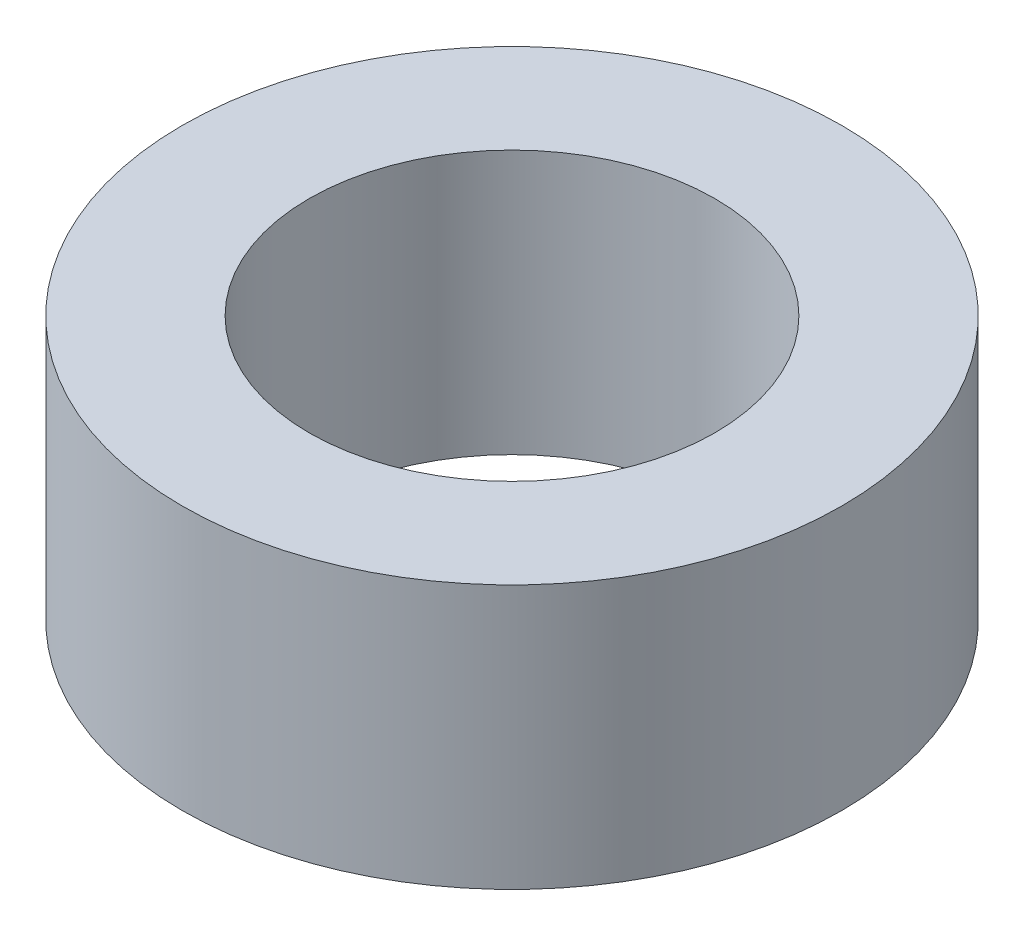
ISO-10303-21;
HEADER;
FILE_DESCRIPTION(('STEP AP214'),'2;1');
FILE_NAME('part.step','',(''),(''),'','','');
FILE_SCHEMA(('AUTOMOTIVE_DESIGN { 1 0 10303 214 1 1 1 1 }'));
ENDSEC;
DATA;
#1=APPLICATION_CONTEXT('core data for automotive mechanical design processes');
#2=APPLICATION_PROTOCOL_DEFINITION('international standard','automotive_design',2000,#1);
#3=PRODUCT_CONTEXT('',#1,'mechanical');
#4=PRODUCT('Part','Part','',(#3));
#5=PRODUCT_RELATED_PRODUCT_CATEGORY('part','',(#4));
#6=PRODUCT_DEFINITION_FORMATION('','',#4);
#7=PRODUCT_DEFINITION_CONTEXT('part definition',#1,'design');
#8=PRODUCT_DEFINITION('design','',#6,#7);
#9=PRODUCT_DEFINITION_SHAPE('','',#8);
#10=(LENGTH_UNIT() NAMED_UNIT(*) SI_UNIT(.MILLI.,.METRE.));
#11=(NAMED_UNIT(*) PLANE_ANGLE_UNIT() SI_UNIT($,.RADIAN.));
#12=(NAMED_UNIT(*) SI_UNIT($,.STERADIAN.) SOLID_ANGLE_UNIT());
#13=UNCERTAINTY_MEASURE_WITH_UNIT(LENGTH_MEASURE(1.E-05),#10,'distance_accuracy_value','');
#14=(GEOMETRIC_REPRESENTATION_CONTEXT(3) GLOBAL_UNCERTAINTY_ASSIGNED_CONTEXT((#13)) GLOBAL_UNIT_ASSIGNED_CONTEXT((#10,
#11,#12)) REPRESENTATION_CONTEXT('',''));
#15=CARTESIAN_POINT('',(0.,0.,0.));
#16=DIRECTION('',(0.,0.,1.));
#17=DIRECTION('',(1.,0.,0.));
#18=AXIS2_PLACEMENT_3D('',#15,#16,#17);
#19=CARTESIAN_POINT('',(0.,26.,0.));
#20=DIRECTION('',(0.,-1.,0.));
#21=DIRECTION('',(0.,0.,-1.));
#22=AXIS2_PLACEMENT_3D('',#19,#20,#21);
#23=CYLINDRICAL_SURFACE('',#22,32.5);
#24=CARTESIAN_POINT('',(0.,26.,0.));
#25=DIRECTION('',(0.,1.,0.));
#26=DIRECTION('',(0.,0.,1.));
#27=AXIS2_PLACEMENT_3D('',#24,#25,#26);
#28=CIRCLE('',#27,32.5);
#29=CARTESIAN_POINT('',(0.,26.,-32.5));
#30=VERTEX_POINT('',#29);
#31=EDGE_CURVE('E10',#30,#30,#28,.T.);
#32=CARTESIAN_POINT('',(0.,0.,0.));
#33=DIRECTION('',(0.,1.,0.));
#34=DIRECTION('',(0.,0.,1.));
#35=AXIS2_PLACEMENT_3D('',#32,#33,#34);
#36=CIRCLE('',#35,32.5);
#37=CARTESIAN_POINT('',(0.,0.,-32.5));
#38=VERTEX_POINT('',#37);
#39=EDGE_CURVE('E37',#38,#38,#36,.T.);
#40=CARTESIAN_POINT('',(0.,26.,-32.5));
#41=CARTESIAN_POINT('',(0.,25.7291666666667,-32.5));
#42=CARTESIAN_POINT('',(0.,25.4583333333333,-32.5));
#43=CARTESIAN_POINT('',(0.,24.9166666666667,-32.5));
#44=CARTESIAN_POINT('',(0.,24.6458333333333,-32.5));
#45=CARTESIAN_POINT('',(0.,24.1041666666667,-32.5));
#46=CARTESIAN_POINT('',(0.,23.8333333333333,-32.5));
#47=CARTESIAN_POINT('',(0.,23.2916666666667,-32.5));
#48=CARTESIAN_POINT('',(0.,23.0208333333333,-32.5));
#49=CARTESIAN_POINT('',(0.,22.4791666666667,-32.5));
#50=CARTESIAN_POINT('',(0.,22.2083333333333,-32.5));
#51=CARTESIAN_POINT('',(0.,21.6666666666667,-32.5));
#52=CARTESIAN_POINT('',(0.,21.3958333333333,-32.5));
#53=CARTESIAN_POINT('',(0.,20.8541666666667,-32.5));
#54=CARTESIAN_POINT('',(0.,20.5833333333333,-32.5));
#55=CARTESIAN_POINT('',(0.,20.0416666666667,-32.5));
#56=CARTESIAN_POINT('',(0.,19.7708333333333,-32.5));
#57=CARTESIAN_POINT('',(0.,19.2291666666667,-32.5));
#58=CARTESIAN_POINT('',(0.,18.9583333333333,-32.5));
#59=CARTESIAN_POINT('',(0.,18.4166666666667,-32.5));
#60=CARTESIAN_POINT('',(0.,18.1458333333333,-32.5));
#61=CARTESIAN_POINT('',(0.,17.6041666666667,-32.5));
#62=CARTESIAN_POINT('',(0.,17.3333333333333,-32.5));
#63=CARTESIAN_POINT('',(0.,16.7916666666667,-32.5));
#64=CARTESIAN_POINT('',(0.,16.5208333333333,-32.5));
#65=CARTESIAN_POINT('',(0.,15.9791666666667,-32.5));
#66=CARTESIAN_POINT('',(0.,15.7083333333333,-32.5));
#67=CARTESIAN_POINT('',(0.,15.1666666666667,-32.5));
#68=CARTESIAN_POINT('',(0.,14.8958333333333,-32.5));
#69=CARTESIAN_POINT('',(0.,14.3541666666667,-32.5));
#70=CARTESIAN_POINT('',(0.,14.0833333333333,-32.5));
#71=CARTESIAN_POINT('',(0.,13.5416666666667,-32.5));
#72=CARTESIAN_POINT('',(0.,13.2708333333333,-32.5));
#73=CARTESIAN_POINT('',(0.,12.7291666666667,-32.5));
#74=CARTESIAN_POINT('',(0.,12.4583333333333,-32.5));
#75=CARTESIAN_POINT('',(0.,11.9166666666667,-32.5));
#76=CARTESIAN_POINT('',(0.,11.6458333333333,-32.5));
#77=CARTESIAN_POINT('',(0.,11.1041666666667,-32.5));
#78=CARTESIAN_POINT('',(0.,10.8333333333333,-32.5));
#79=CARTESIAN_POINT('',(0.,10.2916666666667,-32.5));
#80=CARTESIAN_POINT('',(0.,10.0208333333333,-32.5));
#81=CARTESIAN_POINT('',(0.,9.47916666666667,-32.5));
#82=CARTESIAN_POINT('',(0.,9.20833333333333,-32.5));
#83=CARTESIAN_POINT('',(0.,8.66666666666667,-32.5));
#84=CARTESIAN_POINT('',(0.,8.39583333333333,-32.5));
#85=CARTESIAN_POINT('',(0.,7.85416666666667,-32.5));
#86=CARTESIAN_POINT('',(0.,7.58333333333333,-32.5));
#87=CARTESIAN_POINT('',(0.,7.04166666666667,-32.5));
#88=CARTESIAN_POINT('',(0.,6.77083333333333,-32.5));
#89=CARTESIAN_POINT('',(0.,6.22916666666667,-32.5));
#90=CARTESIAN_POINT('',(0.,5.95833333333333,-32.5));
#91=CARTESIAN_POINT('',(0.,5.41666666666667,-32.5));
#92=CARTESIAN_POINT('',(0.,5.14583333333333,-32.5));
#93=CARTESIAN_POINT('',(0.,4.60416666666667,-32.5));
#94=CARTESIAN_POINT('',(0.,4.33333333333333,-32.5));
#95=CARTESIAN_POINT('',(0.,3.79166666666667,-32.5));
#96=CARTESIAN_POINT('',(0.,3.52083333333333,-32.5));
#97=CARTESIAN_POINT('',(0.,2.97916666666667,-32.5));
#98=CARTESIAN_POINT('',(0.,2.70833333333333,-32.5));
#99=CARTESIAN_POINT('',(0.,2.16666666666667,-32.5));
#100=CARTESIAN_POINT('',(0.,1.89583333333333,-32.5));
#101=CARTESIAN_POINT('',(0.,1.35416666666667,-32.5));
#102=CARTESIAN_POINT('',(0.,1.08333333333333,-32.5));
#103=CARTESIAN_POINT('',(0.,0.541666666666667,-32.5));
#104=CARTESIAN_POINT('',(0.,0.270833333333334,-32.5));
#105=CARTESIAN_POINT('',(0.,0.,-32.5));
#106=B_SPLINE_CURVE_WITH_KNOTS('',3,(#40,#41,#42,#43,#44,#45,#46,#47,#48,#49,#50,#51,#52,#53,
#54,#55,#56,#57,#58,#59,#60,#61,#62,#63,#64,#65,#66,#67,#68,#69,#70,#71,#72,#73,#74,#75,#76,#77,
#78,#79,#80,#81,#82,#83,#84,#85,#86,#87,#88,#89,#90,#91,#92,#93,#94,#95,#96,#97,#98,#99,#100,
#101,#102,#103,#104,#105),.UNSPECIFIED.,.F.,.F.,(4,2,2,2,2,2,2,2,2,2,2,2,2,2,2,2,2,2,2,2,2,2,2,
2,2,2,2,2,2,2,2,2,4),(0.,0.812500000000001,1.625,2.4375,3.25,4.0625,4.875,5.6875,6.5,7.3125,
8.125,8.9375,9.75,10.5625,11.375,12.1875,13.,13.8125,14.625,15.4375,16.25,17.0625,17.875,
18.6875,19.5,20.3125,21.125,21.9375,22.75,23.5625,24.375,25.1875,26.),.UNSPECIFIED.);
#107=EDGE_CURVE('BSEAM40',#30,#38,#106,.T.);
#108=ORIENTED_EDGE('',*,*,#31,.F.);
#109=ORIENTED_EDGE('',*,*,#39,.T.);
#110=ORIENTED_EDGE('',*,*,#107,.T.);
#111=ORIENTED_EDGE('',*,*,#107,.F.);
#112=EDGE_LOOP('',(#108,#110,#109,#111));
#113=FACE_BOUND('',#112,.T.);
#114=ADVANCED_FACE('F40',(#113),#23,.T.);
#115=CARTESIAN_POINT('',(0.,26.,0.));
#116=DIRECTION('',(0.,1.,0.));
#117=DIRECTION('',(0.,0.,1.));
#118=AXIS2_PLACEMENT_3D('',#115,#116,#117);
#119=PLANE('',#118);
#120=CARTESIAN_POINT('',(0.,26.,0.));
#121=DIRECTION('',(0.,1.,0.));
#122=DIRECTION('',(0.,0.,1.));
#123=AXIS2_PLACEMENT_3D('',#120,#121,#122);
#124=CIRCLE('',#123,20.);
#125=CARTESIAN_POINT('',(0.,26.,-20.));
#126=VERTEX_POINT('',#125);
#127=EDGE_CURVE('E50',#126,#126,#124,.T.);
#128=ORIENTED_EDGE('',*,*,#127,.F.);
#129=EDGE_LOOP('',(#128));
#130=FACE_BOUND('',#129,.T.);
#131=ORIENTED_EDGE('',*,*,#31,.T.);
#132=EDGE_LOOP('',(#131));
#133=FACE_BOUND('',#132,.T.);
#134=ADVANCED_FACE('F59',(#130,#133),#119,.T.);
#135=CARTESIAN_POINT('',(0.,0.,0.));
#136=DIRECTION('',(0.,1.,0.));
#137=DIRECTION('',(0.,0.,1.));
#138=AXIS2_PLACEMENT_3D('',#135,#136,#137);
#139=PLANE('',#138);
#140=CARTESIAN_POINT('',(0.,0.,0.));
#141=DIRECTION('',(0.,1.,0.));
#142=DIRECTION('',(0.,0.,1.));
#143=AXIS2_PLACEMENT_3D('',#140,#141,#142);
#144=CIRCLE('',#143,20.);
#145=CARTESIAN_POINT('',(0.,0.,-20.));
#146=VERTEX_POINT('',#145);
#147=EDGE_CURVE('E47',#146,#146,#144,.T.);
#148=ORIENTED_EDGE('',*,*,#147,.T.);
#149=EDGE_LOOP('',(#148));
#150=FACE_BOUND('',#149,.T.);
#151=ORIENTED_EDGE('',*,*,#39,.F.);
#152=EDGE_LOOP('',(#151));
#153=FACE_BOUND('',#152,.T.);
#154=ADVANCED_FACE('F58',(#150,#153),#139,.F.);
#155=CARTESIAN_POINT('',(0.,26.,0.));
#156=DIRECTION('',(0.,-1.,0.));
#157=DIRECTION('',(0.,0.,-1.));
#158=AXIS2_PLACEMENT_3D('',#155,#156,#157);
#159=CYLINDRICAL_SURFACE('',#158,20.);
#160=CARTESIAN_POINT('',(0.,26.,-20.));
#161=CARTESIAN_POINT('',(0.,25.7291666666667,-20.));
#162=CARTESIAN_POINT('',(0.,25.4583333333333,-20.));
#163=CARTESIAN_POINT('',(0.,24.9166666666667,-20.));
#164=CARTESIAN_POINT('',(0.,24.6458333333333,-20.));
#165=CARTESIAN_POINT('',(0.,24.1041666666667,-20.));
#166=CARTESIAN_POINT('',(0.,23.8333333333333,-20.));
#167=CARTESIAN_POINT('',(0.,23.2916666666667,-20.));
#168=CARTESIAN_POINT('',(0.,23.0208333333333,-20.));
#169=CARTESIAN_POINT('',(0.,22.4791666666667,-20.));
#170=CARTESIAN_POINT('',(0.,22.2083333333333,-20.));
#171=CARTESIAN_POINT('',(0.,21.6666666666667,-20.));
#172=CARTESIAN_POINT('',(0.,21.3958333333333,-20.));
#173=CARTESIAN_POINT('',(0.,20.8541666666667,-20.));
#174=CARTESIAN_POINT('',(0.,20.5833333333333,-20.));
#175=CARTESIAN_POINT('',(0.,20.0416666666667,-20.));
#176=CARTESIAN_POINT('',(0.,19.7708333333333,-20.));
#177=CARTESIAN_POINT('',(0.,19.2291666666667,-20.));
#178=CARTESIAN_POINT('',(0.,18.9583333333333,-20.));
#179=CARTESIAN_POINT('',(0.,18.4166666666667,-20.));
#180=CARTESIAN_POINT('',(0.,18.1458333333333,-20.));
#181=CARTESIAN_POINT('',(0.,17.6041666666667,-20.));
#182=CARTESIAN_POINT('',(0.,17.3333333333333,-20.));
#183=CARTESIAN_POINT('',(0.,16.7916666666667,-20.));
#184=CARTESIAN_POINT('',(0.,16.5208333333333,-20.));
#185=CARTESIAN_POINT('',(0.,15.9791666666667,-20.));
#186=CARTESIAN_POINT('',(0.,15.7083333333333,-20.));
#187=CARTESIAN_POINT('',(0.,15.1666666666667,-20.));
#188=CARTESIAN_POINT('',(0.,14.8958333333333,-20.));
#189=CARTESIAN_POINT('',(0.,14.3541666666667,-20.));
#190=CARTESIAN_POINT('',(0.,14.0833333333333,-20.));
#191=CARTESIAN_POINT('',(0.,13.5416666666667,-20.));
#192=CARTESIAN_POINT('',(0.,13.2708333333333,-20.));
#193=CARTESIAN_POINT('',(0.,12.7291666666667,-20.));
#194=CARTESIAN_POINT('',(0.,12.4583333333333,-20.));
#195=CARTESIAN_POINT('',(0.,11.9166666666667,-20.));
#196=CARTESIAN_POINT('',(0.,11.6458333333333,-20.));
#197=CARTESIAN_POINT('',(0.,11.1041666666667,-20.));
#198=CARTESIAN_POINT('',(0.,10.8333333333333,-20.));
#199=CARTESIAN_POINT('',(0.,10.2916666666667,-20.));
#200=CARTESIAN_POINT('',(0.,10.0208333333333,-20.));
#201=CARTESIAN_POINT('',(0.,9.47916666666667,-20.));
#202=CARTESIAN_POINT('',(0.,9.20833333333333,-20.));
#203=CARTESIAN_POINT('',(0.,8.66666666666667,-20.));
#204=CARTESIAN_POINT('',(0.,8.39583333333333,-20.));
#205=CARTESIAN_POINT('',(0.,7.85416666666667,-20.));
#206=CARTESIAN_POINT('',(0.,7.58333333333333,-20.));
#207=CARTESIAN_POINT('',(0.,7.04166666666667,-20.));
#208=CARTESIAN_POINT('',(0.,6.77083333333333,-20.));
#209=CARTESIAN_POINT('',(0.,6.22916666666667,-20.));
#210=CARTESIAN_POINT('',(0.,5.95833333333333,-20.));
#211=CARTESIAN_POINT('',(0.,5.41666666666667,-20.));
#212=CARTESIAN_POINT('',(0.,5.14583333333333,-20.));
#213=CARTESIAN_POINT('',(0.,4.60416666666667,-20.));
#214=CARTESIAN_POINT('',(0.,4.33333333333333,-20.));
#215=CARTESIAN_POINT('',(0.,3.79166666666667,-20.));
#216=CARTESIAN_POINT('',(0.,3.52083333333333,-20.));
#217=CARTESIAN_POINT('',(0.,2.97916666666667,-20.));
#218=CARTESIAN_POINT('',(0.,2.70833333333333,-20.));
#219=CARTESIAN_POINT('',(0.,2.16666666666667,-20.));
#220=CARTESIAN_POINT('',(0.,1.89583333333333,-20.));
#221=CARTESIAN_POINT('',(0.,1.35416666666667,-20.));
#222=CARTESIAN_POINT('',(0.,1.08333333333333,-20.));
#223=CARTESIAN_POINT('',(0.,0.541666666666667,-20.));
#224=CARTESIAN_POINT('',(0.,0.270833333333334,-20.));
#225=CARTESIAN_POINT('',(0.,0.,-20.));
#226=B_SPLINE_CURVE_WITH_KNOTS('',3,(#160,#161,#162,#163,#164,#165,#166,#167,#168,#169,#170,
#171,#172,#173,#174,#175,#176,#177,#178,#179,#180,#181,#182,#183,#184,#185,#186,#187,#188,#189,
#190,#191,#192,#193,#194,#195,#196,#197,#198,#199,#200,#201,#202,#203,#204,#205,#206,#207,#208,
#209,#210,#211,#212,#213,#214,#215,#216,#217,#218,#219,#220,#221,#222,#223,#224,#225),
.UNSPECIFIED.,.F.,.F.,(4,2,2,2,2,2,2,2,2,2,2,2,2,2,2,2,2,2,2,2,2,2,2,2,2,2,2,2,2,2,2,2,4),(0.,
0.812500000000001,1.625,2.4375,3.25,4.0625,4.875,5.6875,6.5,7.3125,8.125,8.9375,9.75,10.5625,
11.375,12.1875,13.,13.8125,14.625,15.4375,16.25,17.0625,17.875,18.6875,19.5,20.3125,21.125,
21.9375,22.75,23.5625,24.375,25.1875,26.),.UNSPECIFIED.);
#227=EDGE_CURVE('BSEAM54',#126,#146,#226,.T.);
#228=ORIENTED_EDGE('',*,*,#127,.T.);
#229=ORIENTED_EDGE('',*,*,#147,.F.);
#230=ORIENTED_EDGE('',*,*,#227,.T.);
#231=ORIENTED_EDGE('',*,*,#227,.F.);
#232=EDGE_LOOP('',(#228,#230,#229,#231));
#233=FACE_BOUND('',#232,.T.);
#234=ADVANCED_FACE('F54',(#233),#159,.F.);
#235=CLOSED_SHELL('',(#114,#134,#154,#234));
#236=MANIFOLD_SOLID_BREP('B2',#235);
#237=ADVANCED_BREP_SHAPE_REPRESENTATION('',(#18,#236),#14);
#238=SHAPE_DEFINITION_REPRESENTATION(#9,#237);
ENDSEC;
END-ISO-10303-21;
